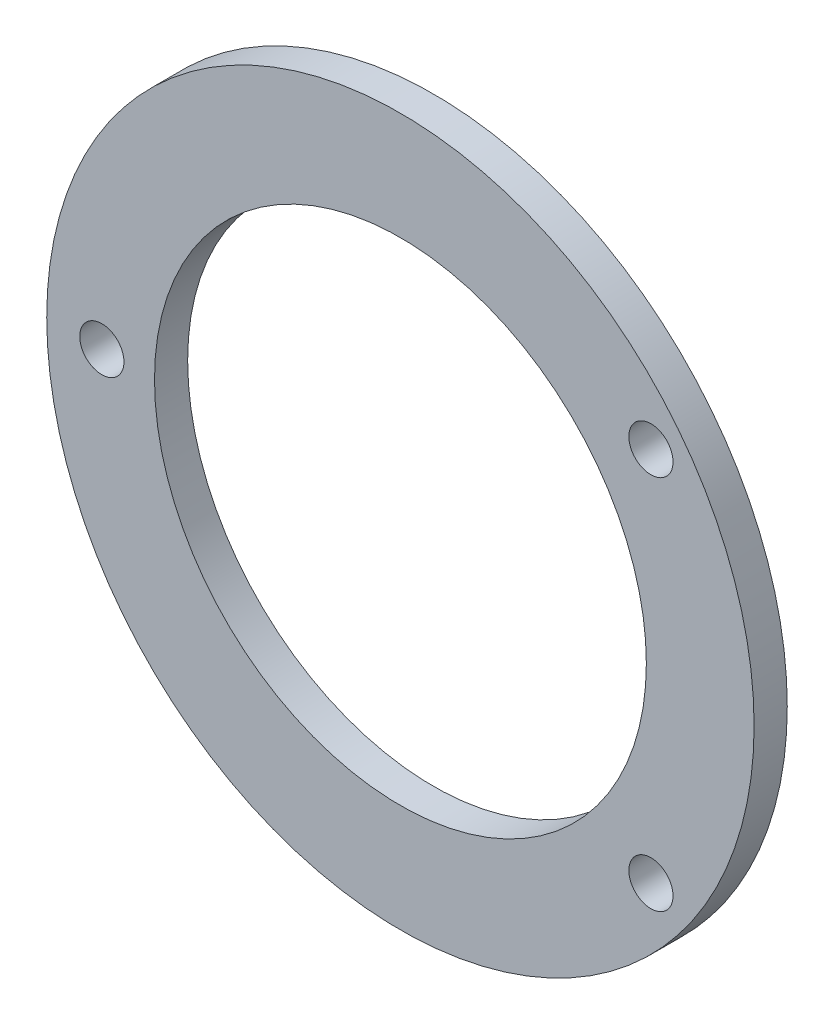
ISO-10303-21;
HEADER;
FILE_DESCRIPTION(('STEP AP214'),'2;1');
FILE_NAME('part.step','',(''),(''),'','','');
FILE_SCHEMA(('AUTOMOTIVE_DESIGN { 1 0 10303 214 1 1 1 1 }'));
ENDSEC;
DATA;
#1=APPLICATION_CONTEXT('core data for automotive mechanical design processes');
#2=APPLICATION_PROTOCOL_DEFINITION('international standard','automotive_design',2000,#1);
#3=PRODUCT_CONTEXT('',#1,'mechanical');
#4=PRODUCT('Part','Part','',(#3));
#5=PRODUCT_RELATED_PRODUCT_CATEGORY('part','',(#4));
#6=PRODUCT_DEFINITION_FORMATION('','',#4);
#7=PRODUCT_DEFINITION_CONTEXT('part definition',#1,'design');
#8=PRODUCT_DEFINITION('design','',#6,#7);
#9=PRODUCT_DEFINITION_SHAPE('','',#8);
#10=(LENGTH_UNIT() NAMED_UNIT(*) SI_UNIT(.MILLI.,.METRE.));
#11=(NAMED_UNIT(*) PLANE_ANGLE_UNIT() SI_UNIT($,.RADIAN.));
#12=(NAMED_UNIT(*) SI_UNIT($,.STERADIAN.) SOLID_ANGLE_UNIT());
#13=UNCERTAINTY_MEASURE_WITH_UNIT(LENGTH_MEASURE(1.E-05),#10,'distance_accuracy_value','');
#14=(GEOMETRIC_REPRESENTATION_CONTEXT(3) GLOBAL_UNCERTAINTY_ASSIGNED_CONTEXT((#13)) GLOBAL_UNIT_ASSIGNED_CONTEXT((#10,
#11,#12)) REPRESENTATION_CONTEXT('',''));
#15=CARTESIAN_POINT('',(0.,0.,0.));
#16=DIRECTION('',(0.,0.,1.));
#17=DIRECTION('',(1.,0.,0.));
#18=AXIS2_PLACEMENT_3D('',#15,#16,#17);
#19=CARTESIAN_POINT('',(-2.31052405110371,2.6216973727429,6.));
#20=DIRECTION('',(0.,0.,1.));
#21=DIRECTION('',(1.,0.,0.));
#22=AXIS2_PLACEMENT_3D('',#19,#20,#21);
#23=PLANE('',#22);
#24=CARTESIAN_POINT('',(-56.3405240511037,2.6216973727429,6.));
#25=DIRECTION('',(0.,0.,1.));
#26=DIRECTION('',(1.,0.,0.));
#27=AXIS2_PLACEMENT_3D('',#24,#25,#26);
#28=CIRCLE('',#27,4.00000000000001);
#29=CARTESIAN_POINT('',(-52.3405240511037,2.6216973727429,6.));
#30=VERTEX_POINT('',#29);
#31=EDGE_CURVE('E56',#30,#30,#28,.T.);
#32=ORIENTED_EDGE('',*,*,#31,.F.);
#33=EDGE_LOOP('',(#32));
#34=FACE_BOUND('',#33,.T.);
#35=CARTESIAN_POINT('',(43.0194759488963,-31.3783026272571,6.));
#36=DIRECTION('',(0.,0.,1.));
#37=DIRECTION('',(1.,0.,0.));
#38=AXIS2_PLACEMENT_3D('',#35,#36,#37);
#39=CIRCLE('',#38,4.);
#40=CARTESIAN_POINT('',(47.0194759488963,-31.3783026272571,6.));
#41=VERTEX_POINT('',#40);
#42=EDGE_CURVE('E45',#41,#41,#39,.T.);
#43=ORIENTED_EDGE('',*,*,#42,.F.);
#44=EDGE_LOOP('',(#43));
#45=FACE_BOUND('',#44,.T.);
#46=CARTESIAN_POINT('',(-2.31052405110371,2.6216973727429,6.));
#47=DIRECTION('',(0.,0.,1.));
#48=DIRECTION('',(1.,0.,0.));
#49=AXIS2_PLACEMENT_3D('',#46,#47,#48);
#50=CIRCLE('',#49,64.);
#51=CARTESIAN_POINT('',(61.6894759488963,2.6216973727429,6.));
#52=VERTEX_POINT('',#51);
#53=EDGE_CURVE('E10',#52,#52,#50,.T.);
#54=ORIENTED_EDGE('',*,*,#53,.T.);
#55=EDGE_LOOP('',(#54));
#56=FACE_BOUND('',#55,.T.);
#57=CARTESIAN_POINT('',(43.0194759488963,36.6216973727429,6.));
#58=DIRECTION('',(0.,0.,1.));
#59=DIRECTION('',(1.,0.,0.));
#60=AXIS2_PLACEMENT_3D('',#57,#58,#59);
#61=CIRCLE('',#60,4.00000000000001);
#62=CARTESIAN_POINT('',(47.0194759488963,36.6216973727429,6.));
#63=VERTEX_POINT('',#62);
#64=EDGE_CURVE('E50',#63,#63,#61,.T.);
#65=ORIENTED_EDGE('',*,*,#64,.F.);
#66=EDGE_LOOP('',(#65));
#67=FACE_BOUND('',#66,.T.);
#68=CARTESIAN_POINT('',(-2.31052405110371,2.6216973727429,6.));
#69=DIRECTION('',(0.,0.,1.));
#70=DIRECTION('',(1.,0.,0.));
#71=AXIS2_PLACEMENT_3D('',#68,#69,#70);
#72=CIRCLE('',#71,44.5);
#73=CARTESIAN_POINT('',(42.1894759488963,2.6216973727429,6.));
#74=VERTEX_POINT('',#73);
#75=EDGE_CURVE('E62',#74,#74,#72,.T.);
#76=ORIENTED_EDGE('',*,*,#75,.F.);
#77=EDGE_LOOP('',(#76));
#78=FACE_BOUND('',#77,.T.);
#79=ADVANCED_FACE('F34',(#34,#45,#56,#67,#78),#23,.T.);
#80=CARTESIAN_POINT('',(-2.31052405110371,2.6216973727429,0.));
#81=DIRECTION('',(0.,0.,1.));
#82=DIRECTION('',(1.,0.,0.));
#83=AXIS2_PLACEMENT_3D('',#80,#81,#82);
#84=PLANE('',#83);
#85=CARTESIAN_POINT('',(-2.31052405110371,2.6216973727429,0.));
#86=DIRECTION('',(0.,0.,1.));
#87=DIRECTION('',(1.,0.,0.));
#88=AXIS2_PLACEMENT_3D('',#85,#86,#87);
#89=CIRCLE('',#88,64.);
#90=CARTESIAN_POINT('',(61.6894759488963,2.6216973727429,0.));
#91=VERTEX_POINT('',#90);
#92=EDGE_CURVE('E38',#91,#91,#89,.T.);
#93=ORIENTED_EDGE('',*,*,#92,.F.);
#94=EDGE_LOOP('',(#93));
#95=FACE_BOUND('',#94,.T.);
#96=CARTESIAN_POINT('',(43.0194759488963,-31.3783026272571,0.));
#97=DIRECTION('',(0.,0.,1.));
#98=DIRECTION('',(1.,0.,0.));
#99=AXIS2_PLACEMENT_3D('',#96,#97,#98);
#100=CIRCLE('',#99,4.);
#101=CARTESIAN_POINT('',(47.0194759488963,-31.3783026272571,0.));
#102=VERTEX_POINT('',#101);
#103=EDGE_CURVE('E47',#102,#102,#100,.T.);
#104=ORIENTED_EDGE('',*,*,#103,.T.);
#105=EDGE_LOOP('',(#104));
#106=FACE_BOUND('',#105,.T.);
#107=CARTESIAN_POINT('',(43.0194759488963,36.6216973727429,0.));
#108=DIRECTION('',(0.,0.,1.));
#109=DIRECTION('',(1.,0.,0.));
#110=AXIS2_PLACEMENT_3D('',#107,#108,#109);
#111=CIRCLE('',#110,4.00000000000001);
#112=CARTESIAN_POINT('',(47.0194759488963,36.6216973727429,0.));
#113=VERTEX_POINT('',#112);
#114=EDGE_CURVE('E53',#113,#113,#111,.T.);
#115=ORIENTED_EDGE('',*,*,#114,.T.);
#116=EDGE_LOOP('',(#115));
#117=FACE_BOUND('',#116,.T.);
#118=CARTESIAN_POINT('',(-56.3405240511037,2.6216973727429,0.));
#119=DIRECTION('',(0.,0.,1.));
#120=DIRECTION('',(1.,0.,0.));
#121=AXIS2_PLACEMENT_3D('',#118,#119,#120);
#122=CIRCLE('',#121,4.00000000000001);
#123=CARTESIAN_POINT('',(-52.3405240511037,2.6216973727429,0.));
#124=VERTEX_POINT('',#123);
#125=EDGE_CURVE('E59',#124,#124,#122,.T.);
#126=ORIENTED_EDGE('',*,*,#125,.T.);
#127=EDGE_LOOP('',(#126));
#128=FACE_BOUND('',#127,.T.);
#129=CARTESIAN_POINT('',(-2.31052405110371,2.6216973727429,0.));
#130=DIRECTION('',(0.,0.,1.));
#131=DIRECTION('',(1.,0.,0.));
#132=AXIS2_PLACEMENT_3D('',#129,#130,#131);
#133=CIRCLE('',#132,44.5);
#134=CARTESIAN_POINT('',(42.1894759488963,2.6216973727429,0.));
#135=VERTEX_POINT('',#134);
#136=EDGE_CURVE('E65',#135,#135,#133,.T.);
#137=ORIENTED_EDGE('',*,*,#136,.T.);
#138=EDGE_LOOP('',(#137));
#139=FACE_BOUND('',#138,.T.);
#140=ADVANCED_FACE('F75',(#95,#106,#117,#128,#139),#84,.F.);
#141=CARTESIAN_POINT('',(-2.31052405110371,2.6216973727429,6.));
#142=DIRECTION('',(0.,0.,-1.));
#143=DIRECTION('',(-1.,0.,0.));
#144=AXIS2_PLACEMENT_3D('',#141,#142,#143);
#145=CYLINDRICAL_SURFACE('',#144,64.);
#146=ORIENTED_EDGE('',*,*,#53,.F.);
#147=EDGE_LOOP('',(#146));
#148=FACE_BOUND('',#147,.T.);
#149=ORIENTED_EDGE('',*,*,#92,.T.);
#150=EDGE_LOOP('',(#149));
#151=FACE_BOUND('',#150,.T.);
#152=ADVANCED_FACE('F36',(#148,#151),#145,.T.);
#153=CARTESIAN_POINT('',(43.0194759488963,-31.3783026272571,6.));
#154=DIRECTION('',(0.,0.,-1.));
#155=DIRECTION('',(-1.,0.,0.));
#156=AXIS2_PLACEMENT_3D('',#153,#154,#155);
#157=CYLINDRICAL_SURFACE('',#156,4.);
#158=ORIENTED_EDGE('',*,*,#42,.T.);
#159=EDGE_LOOP('',(#158));
#160=FACE_BOUND('',#159,.T.);
#161=ORIENTED_EDGE('',*,*,#103,.F.);
#162=EDGE_LOOP('',(#161));
#163=FACE_BOUND('',#162,.T.);
#164=ADVANCED_FACE('F85',(#160,#163),#157,.F.);
#165=CARTESIAN_POINT('',(43.0194759488963,36.6216973727429,6.));
#166=DIRECTION('',(0.,0.,-1.));
#167=DIRECTION('',(-1.,0.,0.));
#168=AXIS2_PLACEMENT_3D('',#165,#166,#167);
#169=CYLINDRICAL_SURFACE('',#168,4.00000000000001);
#170=ORIENTED_EDGE('',*,*,#64,.T.);
#171=EDGE_LOOP('',(#170));
#172=FACE_BOUND('',#171,.T.);
#173=ORIENTED_EDGE('',*,*,#114,.F.);
#174=EDGE_LOOP('',(#173));
#175=FACE_BOUND('',#174,.T.);
#176=ADVANCED_FACE('F88',(#172,#175),#169,.F.);
#177=CARTESIAN_POINT('',(-56.3405240511037,2.6216973727429,6.));
#178=DIRECTION('',(0.,0.,-1.));
#179=DIRECTION('',(-1.,0.,0.));
#180=AXIS2_PLACEMENT_3D('',#177,#178,#179);
#181=CYLINDRICAL_SURFACE('',#180,4.00000000000001);
#182=ORIENTED_EDGE('',*,*,#31,.T.);
#183=EDGE_LOOP('',(#182));
#184=FACE_BOUND('',#183,.T.);
#185=ORIENTED_EDGE('',*,*,#125,.F.);
#186=EDGE_LOOP('',(#185));
#187=FACE_BOUND('',#186,.T.);
#188=ADVANCED_FACE('F92',(#184,#187),#181,.F.);
#189=CARTESIAN_POINT('',(-2.31052405110371,2.6216973727429,6.));
#190=DIRECTION('',(0.,0.,-1.));
#191=DIRECTION('',(-1.,0.,0.));
#192=AXIS2_PLACEMENT_3D('',#189,#190,#191);
#193=CYLINDRICAL_SURFACE('',#192,44.5);
#194=ORIENTED_EDGE('',*,*,#75,.T.);
#195=EDGE_LOOP('',(#194));
#196=FACE_BOUND('',#195,.T.);
#197=ORIENTED_EDGE('',*,*,#136,.F.);
#198=EDGE_LOOP('',(#197));
#199=FACE_BOUND('',#198,.T.);
#200=ADVANCED_FACE('F71',(#196,#199),#193,.F.);
#201=CLOSED_SHELL('',(#79,#140,#152,#164,#176,#188,#200));
#202=MANIFOLD_SOLID_BREP('B2',#201);
#203=ADVANCED_BREP_SHAPE_REPRESENTATION('',(#18,#202),#14);
#204=SHAPE_DEFINITION_REPRESENTATION(#9,#203);
ENDSEC;
END-ISO-10303-21;
